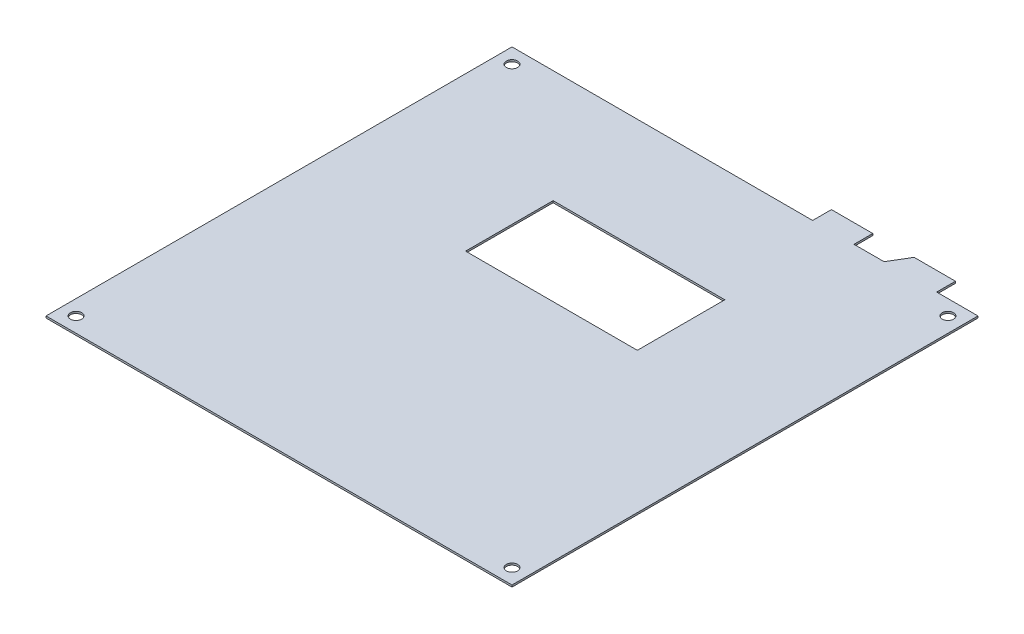
ISO-10303-21;
HEADER;
FILE_DESCRIPTION(('STEP AP214'),'2;1');
FILE_NAME('part.step','',(''),(''),'','','');
FILE_SCHEMA(('AUTOMOTIVE_DESIGN { 1 0 10303 214 1 1 1 1 }'));
ENDSEC;
DATA;
#1=APPLICATION_CONTEXT('core data for automotive mechanical design processes');
#2=APPLICATION_PROTOCOL_DEFINITION('international standard','automotive_design',2000,#1);
#3=PRODUCT_CONTEXT('',#1,'mechanical');
#4=PRODUCT('Part','Part','',(#3));
#5=PRODUCT_RELATED_PRODUCT_CATEGORY('part','',(#4));
#6=PRODUCT_DEFINITION_FORMATION('','',#4);
#7=PRODUCT_DEFINITION_CONTEXT('part definition',#1,'design');
#8=PRODUCT_DEFINITION('design','',#6,#7);
#9=PRODUCT_DEFINITION_SHAPE('','',#8);
#10=(LENGTH_UNIT() NAMED_UNIT(*) SI_UNIT(.MILLI.,.METRE.));
#11=(NAMED_UNIT(*) PLANE_ANGLE_UNIT() SI_UNIT($,.RADIAN.));
#12=(NAMED_UNIT(*) SI_UNIT($,.STERADIAN.) SOLID_ANGLE_UNIT());
#13=UNCERTAINTY_MEASURE_WITH_UNIT(LENGTH_MEASURE(1.E-05),#10,'distance_accuracy_value','');
#14=(GEOMETRIC_REPRESENTATION_CONTEXT(3) GLOBAL_UNCERTAINTY_ASSIGNED_CONTEXT((#13)) GLOBAL_UNIT_ASSIGNED_CONTEXT((#10,
#11,#12)) REPRESENTATION_CONTEXT('',''));
#15=CARTESIAN_POINT('',(0.,0.,0.));
#16=DIRECTION('',(0.,0.,1.));
#17=DIRECTION('',(1.,0.,0.));
#18=AXIS2_PLACEMENT_3D('',#15,#16,#17);
#19=CARTESIAN_POINT('',(0.,0.5,-94.0375261803199));
#20=DIRECTION('',(0.,0.,-1.));
#21=DIRECTION('',(-1.,0.,0.));
#22=AXIS2_PLACEMENT_3D('',#19,#20,#21);
#23=PLANE('',#22);
#24=DIRECTION('',(1.,0.,0.));
#25=VECTOR('',#24,1.);
#26=CARTESIAN_POINT('',(0.,0.,-94.0375261803199));
#27=LINE('',#26,#25);
#28=CARTESIAN_POINT('',(40.8959185238866,0.,-94.0375261803199));
#29=VERTEX_POINT('',#28);
#30=CARTESIAN_POINT('',(86.6002219120619,0.,-94.0375261803199));
#31=VERTEX_POINT('',#30);
#32=EDGE_CURVE('E225',#29,#31,#27,.T.);
#33=ORIENTED_EDGE('',*,*,#32,.T.);
#34=DIRECTION('',(0.,-1.,0.));
#35=VECTOR('',#34,1.);
#36=CARTESIAN_POINT('',(86.6002219120619,0.5,-94.0375261803199));
#37=LINE('',#36,#35);
#38=CARTESIAN_POINT('',(86.6002219120619,0.5,-94.0375261803199));
#39=VERTEX_POINT('',#38);
#40=EDGE_CURVE('E11',#39,#31,#37,.T.);
#41=ORIENTED_EDGE('',*,*,#40,.F.);
#42=DIRECTION('',(1.,0.,0.));
#43=VECTOR('',#42,1.);
#44=CARTESIAN_POINT('',(0.,0.5,-94.0375261803199));
#45=LINE('',#44,#43);
#46=CARTESIAN_POINT('',(40.8959185238866,0.5,-94.0375261803199));
#47=VERTEX_POINT('',#46);
#48=EDGE_CURVE('E167',#47,#39,#45,.T.);
#49=ORIENTED_EDGE('',*,*,#48,.F.);
#50=DIRECTION('',(0.,-1.,0.));
#51=VECTOR('',#50,1.);
#52=CARTESIAN_POINT('',(40.8959185238866,0.5,-94.0375261803199));
#53=LINE('',#52,#51);
#54=EDGE_CURVE('E58',#47,#29,#53,.T.);
#55=ORIENTED_EDGE('',*,*,#54,.T.);
#56=EDGE_LOOP('',(#33,#41,#49,#55));
#57=FACE_BOUND('',#56,.T.);
#58=ADVANCED_FACE('F39',(#57),#23,.F.);
#59=CARTESIAN_POINT('',(86.6002219120619,0.5,0.));
#60=DIRECTION('',(1.,0.,0.));
#61=DIRECTION('',(0.,0.,-1.));
#62=AXIS2_PLACEMENT_3D('',#59,#60,#61);
#63=PLANE('',#62);
#64=DIRECTION('',(0.,0.,1.));
#65=VECTOR('',#64,1.);
#66=CARTESIAN_POINT('',(86.6002219120619,0.,0.));
#67=LINE('',#66,#65);
#68=CARTESIAN_POINT('',(86.6002219120619,0.,-70.7542018127589));
#69=VERTEX_POINT('',#68);
#70=EDGE_CURVE('E173',#31,#69,#67,.T.);
#71=ORIENTED_EDGE('',*,*,#70,.T.);
#72=DIRECTION('',(0.,-1.,0.));
#73=VECTOR('',#72,1.);
#74=CARTESIAN_POINT('',(86.6002219120619,0.5,-70.7542018127589));
#75=LINE('',#74,#73);
#76=CARTESIAN_POINT('',(86.6002219120619,0.5,-70.7542018127589));
#77=VERTEX_POINT('',#76);
#78=EDGE_CURVE('E49',#77,#69,#75,.T.);
#79=ORIENTED_EDGE('',*,*,#78,.F.);
#80=DIRECTION('',(0.,0.,1.));
#81=VECTOR('',#80,1.);
#82=CARTESIAN_POINT('',(86.6002219120619,0.5,0.));
#83=LINE('',#82,#81);
#84=EDGE_CURVE('E161',#39,#77,#83,.T.);
#85=ORIENTED_EDGE('',*,*,#84,.F.);
#86=ORIENTED_EDGE('',*,*,#40,.T.);
#87=EDGE_LOOP('',(#71,#79,#85,#86));
#88=FACE_BOUND('',#87,.T.);
#89=ADVANCED_FACE('F172',(#88),#63,.F.);
#90=CARTESIAN_POINT('',(0.,0.5,-70.7542018127589));
#91=DIRECTION('',(0.,0.,-1.));
#92=DIRECTION('',(-1.,0.,0.));
#93=AXIS2_PLACEMENT_3D('',#90,#91,#92);
#94=PLANE('',#93);
#95=DIRECTION('',(1.,0.,0.));
#96=VECTOR('',#95,1.);
#97=CARTESIAN_POINT('',(0.,0.,-70.7542018127589));
#98=LINE('',#97,#96);
#99=CARTESIAN_POINT('',(40.8959185238866,0.,-70.7542018127589));
#100=VERTEX_POINT('',#99);
#101=EDGE_CURVE('E228',#100,#69,#98,.T.);
#102=ORIENTED_EDGE('',*,*,#101,.F.);
#103=DIRECTION('',(0.,-1.,0.));
#104=VECTOR('',#103,1.);
#105=CARTESIAN_POINT('',(40.8959185238866,0.5,-70.7542018127589));
#106=LINE('',#105,#104);
#107=CARTESIAN_POINT('',(40.8959185238866,0.5,-70.7542018127589));
#108=VERTEX_POINT('',#107);
#109=EDGE_CURVE('E108',#108,#100,#106,.T.);
#110=ORIENTED_EDGE('',*,*,#109,.F.);
#111=DIRECTION('',(1.,0.,0.));
#112=VECTOR('',#111,1.);
#113=CARTESIAN_POINT('',(0.,0.5,-70.7542018127589));
#114=LINE('',#113,#112);
#115=EDGE_CURVE('E166',#108,#77,#114,.T.);
#116=ORIENTED_EDGE('',*,*,#115,.T.);
#117=ORIENTED_EDGE('',*,*,#78,.T.);
#118=EDGE_LOOP('',(#102,#110,#116,#117));
#119=FACE_BOUND('',#118,.T.);
#120=ADVANCED_FACE('F177',(#119),#94,.T.);
#121=CARTESIAN_POINT('',(0.,0.5,0.));
#122=DIRECTION('',(0.,0.,-1.));
#123=DIRECTION('',(-1.,0.,0.));
#124=AXIS2_PLACEMENT_3D('',#121,#122,#123);
#125=PLANE('',#124);
#126=DIRECTION('',(1.,0.,0.));
#127=VECTOR('',#126,1.);
#128=CARTESIAN_POINT('',(0.,0.,0.));
#129=LINE('',#128,#127);
#130=CARTESIAN_POINT('',(0.,0.,0.));
#131=VERTEX_POINT('',#130);
#132=CARTESIAN_POINT('',(124.,0.,0.));
#133=VERTEX_POINT('',#132);
#134=EDGE_CURVE('E196',#131,#133,#129,.T.);
#135=ORIENTED_EDGE('',*,*,#134,.T.);
#136=DIRECTION('',(0.,-1.,0.));
#137=VECTOR('',#136,1.);
#138=CARTESIAN_POINT('',(124.,0.5,0.));
#139=LINE('',#138,#137);
#140=CARTESIAN_POINT('',(124.,0.5,0.));
#141=VERTEX_POINT('',#140);
#142=EDGE_CURVE('E43',#141,#133,#139,.T.);
#143=ORIENTED_EDGE('',*,*,#142,.F.);
#144=DIRECTION('',(1.,0.,0.));
#145=VECTOR('',#144,1.);
#146=CARTESIAN_POINT('',(0.,0.5,0.));
#147=LINE('',#146,#145);
#148=CARTESIAN_POINT('',(0.,0.5,0.));
#149=VERTEX_POINT('',#148);
#150=EDGE_CURVE('E318',#149,#141,#147,.T.);
#151=ORIENTED_EDGE('',*,*,#150,.F.);
#152=DIRECTION('',(0.,-1.,0.));
#153=VECTOR('',#152,1.);
#154=CARTESIAN_POINT('',(0.,0.5,0.));
#155=LINE('',#154,#153);
#156=EDGE_CURVE('E180',#149,#131,#155,.T.);
#157=ORIENTED_EDGE('',*,*,#156,.T.);
#158=EDGE_LOOP('',(#135,#143,#151,#157));
#159=FACE_BOUND('',#158,.T.);
#160=ADVANCED_FACE('F266',(#159),#125,.F.);
#161=CARTESIAN_POINT('',(124.,0.5,0.));
#162=DIRECTION('',(-1.,0.,0.));
#163=DIRECTION('',(0.,0.,1.));
#164=AXIS2_PLACEMENT_3D('',#161,#162,#163);
#165=PLANE('',#164);
#166=DIRECTION('',(0.,0.,-1.));
#167=VECTOR('',#166,1.);
#168=CARTESIAN_POINT('',(124.,0.,0.));
#169=LINE('',#168,#167);
#170=CARTESIAN_POINT('',(124.,0.,-124.));
#171=VERTEX_POINT('',#170);
#172=EDGE_CURVE('E199',#133,#171,#169,.T.);
#173=ORIENTED_EDGE('',*,*,#172,.T.);
#174=DIRECTION('',(0.,-1.,0.));
#175=VECTOR('',#174,1.);
#176=CARTESIAN_POINT('',(124.,0.5,-124.));
#177=LINE('',#176,#175);
#178=CARTESIAN_POINT('',(124.,0.5,-124.));
#179=VERTEX_POINT('',#178);
#180=EDGE_CURVE('E257',#179,#171,#177,.T.);
#181=ORIENTED_EDGE('',*,*,#180,.F.);
#182=DIRECTION('',(0.,0.,-1.));
#183=VECTOR('',#182,1.);
#184=CARTESIAN_POINT('',(124.,0.5,0.));
#185=LINE('',#184,#183);
#186=EDGE_CURVE('E121',#141,#179,#185,.T.);
#187=ORIENTED_EDGE('',*,*,#186,.F.);
#188=ORIENTED_EDGE('',*,*,#142,.T.);
#189=EDGE_LOOP('',(#173,#181,#187,#188));
#190=FACE_BOUND('',#189,.T.);
#191=ADVANCED_FACE('F262',(#190),#165,.F.);
#192=CARTESIAN_POINT('',(0.,0.5,-124.));
#193=DIRECTION('',(0.,0.,-1.));
#194=DIRECTION('',(-1.,0.,0.));
#195=AXIS2_PLACEMENT_3D('',#192,#193,#194);
#196=PLANE('',#195);
#197=DIRECTION('',(1.,0.,0.));
#198=VECTOR('',#197,1.);
#199=CARTESIAN_POINT('',(0.,0.,-124.));
#200=LINE('',#199,#198);
#201=CARTESIAN_POINT('',(113.,0.,-124.));
#202=VERTEX_POINT('',#201);
#203=EDGE_CURVE('E202',#202,#171,#200,.T.);
#204=ORIENTED_EDGE('',*,*,#203,.F.);
#205=DIRECTION('',(0.,-1.,0.));
#206=VECTOR('',#205,1.);
#207=CARTESIAN_POINT('',(113.,0.5,-124.));
#208=LINE('',#207,#206);
#209=CARTESIAN_POINT('',(113.,0.5,-124.));
#210=VERTEX_POINT('',#209);
#211=EDGE_CURVE('E256',#210,#202,#208,.T.);
#212=ORIENTED_EDGE('',*,*,#211,.F.);
#213=DIRECTION('',(1.,0.,0.));
#214=VECTOR('',#213,1.);
#215=CARTESIAN_POINT('',(0.,0.5,-124.));
#216=LINE('',#215,#214);
#217=EDGE_CURVE('E311',#210,#179,#216,.T.);
#218=ORIENTED_EDGE('',*,*,#217,.T.);
#219=ORIENTED_EDGE('',*,*,#180,.T.);
#220=EDGE_LOOP('',(#204,#212,#218,#219));
#221=FACE_BOUND('',#220,.T.);
#222=ADVANCED_FACE('F308',(#221),#196,.T.);
#223=CARTESIAN_POINT('',(113.,0.5,0.));
#224=DIRECTION('',(-1.,0.,0.));
#225=DIRECTION('',(0.,0.,1.));
#226=AXIS2_PLACEMENT_3D('',#223,#224,#225);
#227=PLANE('',#226);
#228=DIRECTION('',(0.,0.,-1.));
#229=VECTOR('',#228,1.);
#230=CARTESIAN_POINT('',(113.,0.,0.));
#231=LINE('',#230,#229);
#232=CARTESIAN_POINT('',(113.,0.,-129.));
#233=VERTEX_POINT('',#232);
#234=EDGE_CURVE('E205',#202,#233,#231,.T.);
#235=ORIENTED_EDGE('',*,*,#234,.T.);
#236=DIRECTION('',(0.,-1.,0.));
#237=VECTOR('',#236,1.);
#238=CARTESIAN_POINT('',(113.,0.5,-129.));
#239=LINE('',#238,#237);
#240=CARTESIAN_POINT('',(113.,0.5,-129.));
#241=VERTEX_POINT('',#240);
#242=EDGE_CURVE('E253',#241,#233,#239,.T.);
#243=ORIENTED_EDGE('',*,*,#242,.F.);
#244=DIRECTION('',(0.,0.,-1.));
#245=VECTOR('',#244,1.);
#246=CARTESIAN_POINT('',(113.,0.5,0.));
#247=LINE('',#246,#245);
#248=EDGE_CURVE('E312',#210,#241,#247,.T.);
#249=ORIENTED_EDGE('',*,*,#248,.F.);
#250=ORIENTED_EDGE('',*,*,#211,.T.);
#251=EDGE_LOOP('',(#235,#243,#249,#250));
#252=FACE_BOUND('',#251,.T.);
#253=ADVANCED_FACE('F313',(#252),#227,.F.);
#254=CARTESIAN_POINT('',(0.,0.5,-129.));
#255=DIRECTION('',(0.,0.,1.));
#256=DIRECTION('',(1.,0.,0.));
#257=AXIS2_PLACEMENT_3D('',#254,#255,#256);
#258=PLANE('',#257);
#259=DIRECTION('',(-1.,0.,0.));
#260=VECTOR('',#259,1.);
#261=CARTESIAN_POINT('',(0.,0.,-129.));
#262=LINE('',#261,#260);
#263=CARTESIAN_POINT('',(102.,0.,-129.));
#264=VERTEX_POINT('',#263);
#265=EDGE_CURVE('E209',#233,#264,#262,.T.);
#266=ORIENTED_EDGE('',*,*,#265,.T.);
#267=DIRECTION('',(0.,-1.,0.));
#268=VECTOR('',#267,1.);
#269=CARTESIAN_POINT('',(102.,0.5,-129.));
#270=LINE('',#269,#268);
#271=CARTESIAN_POINT('',(102.,0.5,-129.));
#272=VERTEX_POINT('',#271);
#273=EDGE_CURVE('E250',#272,#264,#270,.T.);
#274=ORIENTED_EDGE('',*,*,#273,.F.);
#275=DIRECTION('',(-1.,0.,0.));
#276=VECTOR('',#275,1.);
#277=CARTESIAN_POINT('',(0.,0.5,-129.));
#278=LINE('',#277,#276);
#279=EDGE_CURVE('E304',#241,#272,#278,.T.);
#280=ORIENTED_EDGE('',*,*,#279,.F.);
#281=ORIENTED_EDGE('',*,*,#242,.T.);
#282=EDGE_LOOP('',(#266,#274,#280,#281));
#283=FACE_BOUND('',#282,.T.);
#284=ADVANCED_FACE('F303',(#283),#258,.F.);
#285=CARTESIAN_POINT('',(18.0882352941176,0.5,10.8529411764706));
#286=DIRECTION('',(0.857492925712544,0.,0.514495755427527));
#287=DIRECTION('',(0.514495755427527,0.,-0.857492925712544));
#288=AXIS2_PLACEMENT_3D('',#285,#286,#287);
#289=PLANE('',#288);
#290=DIRECTION('',(-0.514495755427527,0.,0.857492925712544));
#291=VECTOR('',#290,1.);
#292=CARTESIAN_POINT('',(18.0882352941176,0.,10.8529411764706));
#293=LINE('',#292,#291);
#294=CARTESIAN_POINT('',(99.,0.,-124.));
#295=VERTEX_POINT('',#294);
#296=EDGE_CURVE('E211',#264,#295,#293,.T.);
#297=ORIENTED_EDGE('',*,*,#296,.T.);
#298=DIRECTION('',(0.,-1.,0.));
#299=VECTOR('',#298,1.);
#300=CARTESIAN_POINT('',(99.,0.5,-124.));
#301=LINE('',#300,#299);
#302=CARTESIAN_POINT('',(99.,0.5,-124.));
#303=VERTEX_POINT('',#302);
#304=EDGE_CURVE('E248',#303,#295,#301,.T.);
#305=ORIENTED_EDGE('',*,*,#304,.F.);
#306=DIRECTION('',(-0.514495755427527,0.,0.857492925712544));
#307=VECTOR('',#306,1.);
#308=CARTESIAN_POINT('',(18.0882352941176,0.5,10.8529411764706));
#309=LINE('',#308,#307);
#310=EDGE_CURVE('E300',#272,#303,#309,.T.);
#311=ORIENTED_EDGE('',*,*,#310,.F.);
#312=ORIENTED_EDGE('',*,*,#273,.T.);
#313=EDGE_LOOP('',(#297,#305,#311,#312));
#314=FACE_BOUND('',#313,.T.);
#315=ADVANCED_FACE('F298',(#314),#289,.F.);
#316=CARTESIAN_POINT('',(91.,0.,-124.));
#317=VERTEX_POINT('',#316);
#318=EDGE_CURVE('E207',#317,#295,#200,.T.);
#319=ORIENTED_EDGE('',*,*,#318,.F.);
#320=DIRECTION('',(0.,-1.,0.));
#321=VECTOR('',#320,1.);
#322=CARTESIAN_POINT('',(91.,0.5,-124.));
#323=LINE('',#322,#321);
#324=CARTESIAN_POINT('',(91.,0.5,-124.));
#325=VERTEX_POINT('',#324);
#326=EDGE_CURVE('E246',#325,#317,#323,.T.);
#327=ORIENTED_EDGE('',*,*,#326,.F.);
#328=EDGE_CURVE('E295',#325,#303,#216,.T.);
#329=ORIENTED_EDGE('',*,*,#328,.T.);
#330=ORIENTED_EDGE('',*,*,#304,.T.);
#331=EDGE_LOOP('',(#319,#327,#329,#330));
#332=FACE_BOUND('',#331,.T.);
#333=ADVANCED_FACE('F290',(#332),#196,.T.);
#334=CARTESIAN_POINT('',(91.,0.5,0.));
#335=DIRECTION('',(-1.,0.,0.));
#336=DIRECTION('',(0.,0.,1.));
#337=AXIS2_PLACEMENT_3D('',#334,#335,#336);
#338=PLANE('',#337);
#339=DIRECTION('',(0.,0.,-1.));
#340=VECTOR('',#339,1.);
#341=CARTESIAN_POINT('',(91.,0.,0.));
#342=LINE('',#341,#340);
#343=CARTESIAN_POINT('',(91.,0.,-129.));
#344=VERTEX_POINT('',#343);
#345=EDGE_CURVE('E214',#317,#344,#342,.T.);
#346=ORIENTED_EDGE('',*,*,#345,.T.);
#347=DIRECTION('',(0.,-1.,0.));
#348=VECTOR('',#347,1.);
#349=CARTESIAN_POINT('',(91.,0.5,-129.));
#350=LINE('',#349,#348);
#351=CARTESIAN_POINT('',(91.,0.5,-129.));
#352=VERTEX_POINT('',#351);
#353=EDGE_CURVE('E243',#352,#344,#350,.T.);
#354=ORIENTED_EDGE('',*,*,#353,.F.);
#355=DIRECTION('',(0.,0.,-1.));
#356=VECTOR('',#355,1.);
#357=CARTESIAN_POINT('',(91.,0.5,0.));
#358=LINE('',#357,#356);
#359=EDGE_CURVE('E321',#325,#352,#358,.T.);
#360=ORIENTED_EDGE('',*,*,#359,.F.);
#361=ORIENTED_EDGE('',*,*,#326,.T.);
#362=EDGE_LOOP('',(#346,#354,#360,#361));
#363=FACE_BOUND('',#362,.T.);
#364=ADVANCED_FACE('F339',(#363),#338,.F.);
#365=CARTESIAN_POINT('',(0.,0.5,-129.));
#366=DIRECTION('',(0.,0.,1.));
#367=DIRECTION('',(1.,0.,0.));
#368=AXIS2_PLACEMENT_3D('',#365,#366,#367);
#369=PLANE('',#368);
#370=DIRECTION('',(-1.,0.,0.));
#371=VECTOR('',#370,1.);
#372=CARTESIAN_POINT('',(0.,0.,-129.));
#373=LINE('',#372,#371);
#374=CARTESIAN_POINT('',(80.,0.,-129.));
#375=VERTEX_POINT('',#374);
#376=EDGE_CURVE('E216',#344,#375,#373,.T.);
#377=ORIENTED_EDGE('',*,*,#376,.T.);
#378=DIRECTION('',(0.,-1.,0.));
#379=VECTOR('',#378,1.);
#380=CARTESIAN_POINT('',(80.,0.5,-129.));
#381=LINE('',#380,#379);
#382=CARTESIAN_POINT('',(80.,0.5,-129.));
#383=VERTEX_POINT('',#382);
#384=EDGE_CURVE('E241',#383,#375,#381,.T.);
#385=ORIENTED_EDGE('',*,*,#384,.F.);
#386=DIRECTION('',(-1.,0.,0.));
#387=VECTOR('',#386,1.);
#388=CARTESIAN_POINT('',(0.,0.5,-129.));
#389=LINE('',#388,#387);
#390=EDGE_CURVE('E322',#352,#383,#389,.T.);
#391=ORIENTED_EDGE('',*,*,#390,.F.);
#392=ORIENTED_EDGE('',*,*,#353,.T.);
#393=EDGE_LOOP('',(#377,#385,#391,#392));
#394=FACE_BOUND('',#393,.T.);
#395=ADVANCED_FACE('F337',(#394),#369,.F.);
#396=CARTESIAN_POINT('',(80.,0.5,0.));
#397=DIRECTION('',(-1.,0.,0.));
#398=DIRECTION('',(0.,0.,1.));
#399=AXIS2_PLACEMENT_3D('',#396,#397,#398);
#400=PLANE('',#399);
#401=DIRECTION('',(0.,0.,-1.));
#402=VECTOR('',#401,1.);
#403=CARTESIAN_POINT('',(80.,0.,0.));
#404=LINE('',#403,#402);
#405=CARTESIAN_POINT('',(80.,0.,-124.));
#406=VERTEX_POINT('',#405);
#407=EDGE_CURVE('E219',#406,#375,#404,.T.);
#408=ORIENTED_EDGE('',*,*,#407,.F.);
#409=DIRECTION('',(0.,-1.,0.));
#410=VECTOR('',#409,1.);
#411=CARTESIAN_POINT('',(80.,0.5,-124.));
#412=LINE('',#411,#410);
#413=CARTESIAN_POINT('',(80.,0.5,-124.));
#414=VERTEX_POINT('',#413);
#415=EDGE_CURVE('E239',#414,#406,#412,.T.);
#416=ORIENTED_EDGE('',*,*,#415,.F.);
#417=DIRECTION('',(0.,0.,-1.));
#418=VECTOR('',#417,1.);
#419=CARTESIAN_POINT('',(80.,0.5,0.));
#420=LINE('',#419,#418);
#421=EDGE_CURVE('E320',#414,#383,#420,.T.);
#422=ORIENTED_EDGE('',*,*,#421,.T.);
#423=ORIENTED_EDGE('',*,*,#384,.T.);
#424=EDGE_LOOP('',(#408,#416,#422,#423));
#425=FACE_BOUND('',#424,.T.);
#426=ADVANCED_FACE('F332',(#425),#400,.T.);
#427=CARTESIAN_POINT('',(0.,0.,-124.));
#428=VERTEX_POINT('',#427);
#429=EDGE_CURVE('E206',#428,#406,#200,.T.);
#430=ORIENTED_EDGE('',*,*,#429,.F.);
#431=DIRECTION('',(0.,-1.,0.));
#432=VECTOR('',#431,1.);
#433=CARTESIAN_POINT('',(0.,0.5,-124.));
#434=LINE('',#433,#432);
#435=CARTESIAN_POINT('',(0.,0.5,-124.));
#436=VERTEX_POINT('',#435);
#437=EDGE_CURVE('E237',#436,#428,#434,.T.);
#438=ORIENTED_EDGE('',*,*,#437,.F.);
#439=EDGE_CURVE('E317',#436,#414,#216,.T.);
#440=ORIENTED_EDGE('',*,*,#439,.T.);
#441=ORIENTED_EDGE('',*,*,#415,.T.);
#442=EDGE_LOOP('',(#430,#438,#440,#441));
#443=FACE_BOUND('',#442,.T.);
#444=ADVANCED_FACE('F281',(#443),#196,.T.);
#445=CARTESIAN_POINT('',(0.,0.5,0.));
#446=DIRECTION('',(-1.,0.,0.));
#447=DIRECTION('',(0.,0.,1.));
#448=AXIS2_PLACEMENT_3D('',#445,#446,#447);
#449=PLANE('',#448);
#450=DIRECTION('',(0.,0.,-1.));
#451=VECTOR('',#450,1.);
#452=CARTESIAN_POINT('',(0.,0.,0.));
#453=LINE('',#452,#451);
#454=EDGE_CURVE('E222',#131,#428,#453,.T.);
#455=ORIENTED_EDGE('',*,*,#454,.F.);
#456=ORIENTED_EDGE('',*,*,#156,.F.);
#457=DIRECTION('',(0.,0.,-1.));
#458=VECTOR('',#457,1.);
#459=CARTESIAN_POINT('',(0.,0.5,0.));
#460=LINE('',#459,#458);
#461=EDGE_CURVE('E277',#149,#436,#460,.T.);
#462=ORIENTED_EDGE('',*,*,#461,.T.);
#463=ORIENTED_EDGE('',*,*,#437,.T.);
#464=EDGE_LOOP('',(#455,#456,#462,#463));
#465=FACE_BOUND('',#464,.T.);
#466=ADVANCED_FACE('F273',(#465),#449,.T.);
#467=CARTESIAN_POINT('',(120.,0.5,-120.));
#468=DIRECTION('',(0.,-1.,0.));
#469=DIRECTION('',(0.,0.,-1.));
#470=AXIS2_PLACEMENT_3D('',#467,#468,#469);
#471=CYLINDRICAL_SURFACE('',#470,1.5);
#472=CARTESIAN_POINT('',(120.,0.5,-120.));
#473=DIRECTION('',(0.,1.,0.));
#474=DIRECTION('',(0.,0.,1.));
#475=AXIS2_PLACEMENT_3D('',#472,#473,#474);
#476=CIRCLE('',#475,1.5);
#477=CARTESIAN_POINT('',(120.,0.5,-118.5));
#478=VERTEX_POINT('',#477);
#479=EDGE_CURVE('E576',#478,#478,#476,.T.);
#480=ORIENTED_EDGE('',*,*,#479,.T.);
#481=EDGE_LOOP('',(#480));
#482=FACE_BOUND('',#481,.T.);
#483=CARTESIAN_POINT('',(120.,0.,-120.));
#484=DIRECTION('',(0.,1.,0.));
#485=DIRECTION('',(0.,0.,1.));
#486=AXIS2_PLACEMENT_3D('',#483,#484,#485);
#487=CIRCLE('',#486,1.5);
#488=CARTESIAN_POINT('',(120.,0.,-118.5));
#489=VERTEX_POINT('',#488);
#490=EDGE_CURVE('E193',#489,#489,#487,.T.);
#491=ORIENTED_EDGE('',*,*,#490,.F.);
#492=EDGE_LOOP('',(#491));
#493=FACE_BOUND('',#492,.T.);
#494=ADVANCED_FACE('F358',(#482,#493),#471,.F.);
#495=CARTESIAN_POINT('',(120.,0.5,-4.));
#496=DIRECTION('',(0.,-1.,0.));
#497=DIRECTION('',(0.,0.,-1.));
#498=AXIS2_PLACEMENT_3D('',#495,#496,#497);
#499=CYLINDRICAL_SURFACE('',#498,1.5);
#500=CARTESIAN_POINT('',(120.,0.5,-4.));
#501=DIRECTION('',(0.,1.,0.));
#502=DIRECTION('',(0.,0.,1.));
#503=AXIS2_PLACEMENT_3D('',#500,#501,#502);
#504=CIRCLE('',#503,1.5);
#505=CARTESIAN_POINT('',(120.,0.5,-2.5));
#506=VERTEX_POINT('',#505);
#507=EDGE_CURVE('E573',#506,#506,#504,.T.);
#508=ORIENTED_EDGE('',*,*,#507,.T.);
#509=EDGE_LOOP('',(#508));
#510=FACE_BOUND('',#509,.T.);
#511=CARTESIAN_POINT('',(120.,0.,-4.));
#512=DIRECTION('',(0.,1.,0.));
#513=DIRECTION('',(0.,0.,1.));
#514=AXIS2_PLACEMENT_3D('',#511,#512,#513);
#515=CIRCLE('',#514,1.5);
#516=CARTESIAN_POINT('',(120.,0.,-2.5));
#517=VERTEX_POINT('',#516);
#518=EDGE_CURVE('E190',#517,#517,#515,.T.);
#519=ORIENTED_EDGE('',*,*,#518,.F.);
#520=EDGE_LOOP('',(#519));
#521=FACE_BOUND('',#520,.T.);
#522=ADVANCED_FACE('F380',(#510,#521),#499,.F.);
#523=CARTESIAN_POINT('',(4.,0.5,-4.));
#524=DIRECTION('',(0.,-1.,0.));
#525=DIRECTION('',(0.,0.,-1.));
#526=AXIS2_PLACEMENT_3D('',#523,#524,#525);
#527=CYLINDRICAL_SURFACE('',#526,1.5);
#528=CARTESIAN_POINT('',(4.,0.5,-4.));
#529=DIRECTION('',(0.,1.,0.));
#530=DIRECTION('',(0.,0.,1.));
#531=AXIS2_PLACEMENT_3D('',#528,#529,#530);
#532=CIRCLE('',#531,1.5);
#533=CARTESIAN_POINT('',(4.,0.5,-2.5));
#534=VERTEX_POINT('',#533);
#535=EDGE_CURVE('E569',#534,#534,#532,.T.);
#536=ORIENTED_EDGE('',*,*,#535,.T.);
#537=EDGE_LOOP('',(#536));
#538=FACE_BOUND('',#537,.T.);
#539=CARTESIAN_POINT('',(4.,0.,-4.));
#540=DIRECTION('',(0.,1.,0.));
#541=DIRECTION('',(0.,0.,1.));
#542=AXIS2_PLACEMENT_3D('',#539,#540,#541);
#543=CIRCLE('',#542,1.5);
#544=CARTESIAN_POINT('',(4.,0.,-2.5));
#545=VERTEX_POINT('',#544);
#546=EDGE_CURVE('E187',#545,#545,#543,.T.);
#547=ORIENTED_EDGE('',*,*,#546,.F.);
#548=EDGE_LOOP('',(#547));
#549=FACE_BOUND('',#548,.T.);
#550=ADVANCED_FACE('F388',(#538,#549),#527,.F.);
#551=CARTESIAN_POINT('',(4.,0.5,-120.));
#552=DIRECTION('',(0.,-1.,0.));
#553=DIRECTION('',(0.,0.,-1.));
#554=AXIS2_PLACEMENT_3D('',#551,#552,#553);
#555=CYLINDRICAL_SURFACE('',#554,1.5);
#556=CARTESIAN_POINT('',(4.,0.5,-120.));
#557=DIRECTION('',(0.,1.,0.));
#558=DIRECTION('',(0.,0.,1.));
#559=AXIS2_PLACEMENT_3D('',#556,#557,#558);
#560=CIRCLE('',#559,1.5);
#561=CARTESIAN_POINT('',(4.,0.5,-118.5));
#562=VERTEX_POINT('',#561);
#563=EDGE_CURVE('E233',#562,#562,#560,.T.);
#564=ORIENTED_EDGE('',*,*,#563,.T.);
#565=EDGE_LOOP('',(#564));
#566=FACE_BOUND('',#565,.T.);
#567=CARTESIAN_POINT('',(4.,0.,-120.));
#568=DIRECTION('',(0.,1.,0.));
#569=DIRECTION('',(0.,0.,1.));
#570=AXIS2_PLACEMENT_3D('',#567,#568,#569);
#571=CIRCLE('',#570,1.5);
#572=CARTESIAN_POINT('',(4.,0.,-118.5));
#573=VERTEX_POINT('',#572);
#574=EDGE_CURVE('E184',#573,#573,#571,.T.);
#575=ORIENTED_EDGE('',*,*,#574,.F.);
#576=EDGE_LOOP('',(#575));
#577=FACE_BOUND('',#576,.T.);
#578=ADVANCED_FACE('F41',(#566,#577),#555,.F.);
#579=CARTESIAN_POINT('',(40.8959185238866,0.5,0.));
#580=DIRECTION('',(1.,0.,0.));
#581=DIRECTION('',(0.,0.,-1.));
#582=AXIS2_PLACEMENT_3D('',#579,#580,#581);
#583=PLANE('',#582);
#584=DIRECTION('',(0.,0.,1.));
#585=VECTOR('',#584,1.);
#586=CARTESIAN_POINT('',(40.8959185238866,0.,0.));
#587=LINE('',#586,#585);
#588=EDGE_CURVE('E230',#29,#100,#587,.T.);
#589=ORIENTED_EDGE('',*,*,#588,.F.);
#590=ORIENTED_EDGE('',*,*,#54,.F.);
#591=DIRECTION('',(0.,0.,1.));
#592=VECTOR('',#591,1.);
#593=CARTESIAN_POINT('',(40.8959185238866,0.5,0.));
#594=LINE('',#593,#592);
#595=EDGE_CURVE('E178',#47,#108,#594,.T.);
#596=ORIENTED_EDGE('',*,*,#595,.T.);
#597=ORIENTED_EDGE('',*,*,#109,.T.);
#598=EDGE_LOOP('',(#589,#590,#596,#597));
#599=FACE_BOUND('',#598,.T.);
#600=ADVANCED_FACE('F402',(#599),#583,.T.);
#601=CARTESIAN_POINT('',(0.,0.5,0.));
#602=DIRECTION('',(0.,1.,0.));
#603=DIRECTION('',(0.,0.,1.));
#604=AXIS2_PLACEMENT_3D('',#601,#602,#603);
#605=PLANE('',#604);
#606=ORIENTED_EDGE('',*,*,#563,.F.);
#607=EDGE_LOOP('',(#606));
#608=FACE_BOUND('',#607,.T.);
#609=ORIENTED_EDGE('',*,*,#535,.F.);
#610=EDGE_LOOP('',(#609));
#611=FACE_BOUND('',#610,.T.);
#612=ORIENTED_EDGE('',*,*,#507,.F.);
#613=EDGE_LOOP('',(#612));
#614=FACE_BOUND('',#613,.T.);
#615=ORIENTED_EDGE('',*,*,#479,.F.);
#616=EDGE_LOOP('',(#615));
#617=FACE_BOUND('',#616,.T.);
#618=ORIENTED_EDGE('',*,*,#150,.T.);
#619=ORIENTED_EDGE('',*,*,#186,.T.);
#620=ORIENTED_EDGE('',*,*,#217,.F.);
#621=ORIENTED_EDGE('',*,*,#248,.T.);
#622=ORIENTED_EDGE('',*,*,#279,.T.);
#623=ORIENTED_EDGE('',*,*,#310,.T.);
#624=ORIENTED_EDGE('',*,*,#328,.F.);
#625=ORIENTED_EDGE('',*,*,#359,.T.);
#626=ORIENTED_EDGE('',*,*,#390,.T.);
#627=ORIENTED_EDGE('',*,*,#421,.F.);
#628=ORIENTED_EDGE('',*,*,#439,.F.);
#629=ORIENTED_EDGE('',*,*,#461,.F.);
#630=EDGE_LOOP('',(#618,#619,#620,#621,#622,#623,#624,#625,#626,#627,#628,#629));
#631=FACE_BOUND('',#630,.T.);
#632=ORIENTED_EDGE('',*,*,#48,.T.);
#633=ORIENTED_EDGE('',*,*,#84,.T.);
#634=ORIENTED_EDGE('',*,*,#115,.F.);
#635=ORIENTED_EDGE('',*,*,#595,.F.);
#636=EDGE_LOOP('',(#632,#633,#634,#635));
#637=FACE_BOUND('',#636,.T.);
#638=ADVANCED_FACE('F163',(#608,#611,#614,#617,#631,#637),#605,.T.);
#639=CARTESIAN_POINT('',(0.,0.,0.));
#640=DIRECTION('',(0.,1.,0.));
#641=DIRECTION('',(0.,0.,1.));
#642=AXIS2_PLACEMENT_3D('',#639,#640,#641);
#643=PLANE('',#642);
#644=ORIENTED_EDGE('',*,*,#574,.T.);
#645=EDGE_LOOP('',(#644));
#646=FACE_BOUND('',#645,.T.);
#647=ORIENTED_EDGE('',*,*,#546,.T.);
#648=EDGE_LOOP('',(#647));
#649=FACE_BOUND('',#648,.T.);
#650=ORIENTED_EDGE('',*,*,#518,.T.);
#651=EDGE_LOOP('',(#650));
#652=FACE_BOUND('',#651,.T.);
#653=ORIENTED_EDGE('',*,*,#490,.T.);
#654=EDGE_LOOP('',(#653));
#655=FACE_BOUND('',#654,.T.);
#656=ORIENTED_EDGE('',*,*,#134,.F.);
#657=ORIENTED_EDGE('',*,*,#454,.T.);
#658=ORIENTED_EDGE('',*,*,#429,.T.);
#659=ORIENTED_EDGE('',*,*,#407,.T.);
#660=ORIENTED_EDGE('',*,*,#376,.F.);
#661=ORIENTED_EDGE('',*,*,#345,.F.);
#662=ORIENTED_EDGE('',*,*,#318,.T.);
#663=ORIENTED_EDGE('',*,*,#296,.F.);
#664=ORIENTED_EDGE('',*,*,#265,.F.);
#665=ORIENTED_EDGE('',*,*,#234,.F.);
#666=ORIENTED_EDGE('',*,*,#203,.T.);
#667=ORIENTED_EDGE('',*,*,#172,.F.);
#668=EDGE_LOOP('',(#656,#657,#658,#659,#660,#661,#662,#663,#664,#665,#666,#667));
#669=FACE_BOUND('',#668,.T.);
#670=ORIENTED_EDGE('',*,*,#32,.F.);
#671=ORIENTED_EDGE('',*,*,#588,.T.);
#672=ORIENTED_EDGE('',*,*,#101,.T.);
#673=ORIENTED_EDGE('',*,*,#70,.F.);
#674=EDGE_LOOP('',(#670,#671,#672,#673));
#675=FACE_BOUND('',#674,.T.);
#676=ADVANCED_FACE('F269',(#646,#649,#652,#655,#669,#675),#643,.F.);
#677=CLOSED_SHELL('',(#58,#89,#120,#160,#191,#222,#253,#284,#315,#333,#364,#395,#426,#444,#466,
#494,#522,#550,#578,#600,#638,#676));
#678=MANIFOLD_SOLID_BREP('B2',#677);
#679=ADVANCED_BREP_SHAPE_REPRESENTATION('',(#18,#678),#14);
#680=SHAPE_DEFINITION_REPRESENTATION(#9,#679);
ENDSEC;
END-ISO-10303-21;
